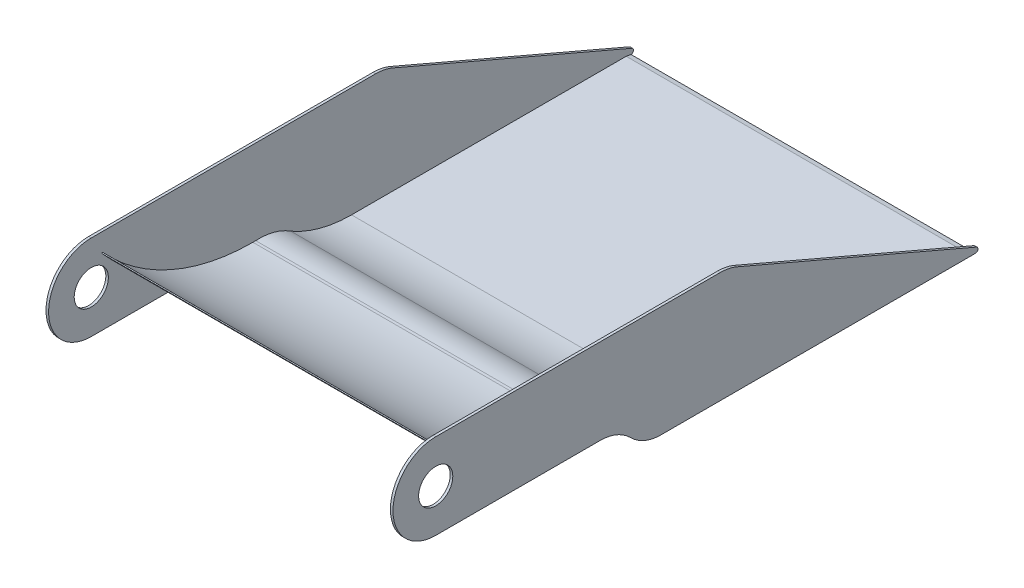
ISO-10303-21;
HEADER;
FILE_DESCRIPTION(('STEP AP214'),'2;1');
FILE_NAME('part.step','',(''),(''),'','','');
FILE_SCHEMA(('AUTOMOTIVE_DESIGN { 1 0 10303 214 1 1 1 1 }'));
ENDSEC;
DATA;
#1=APPLICATION_CONTEXT('core data for automotive mechanical design processes');
#2=APPLICATION_PROTOCOL_DEFINITION('international standard','automotive_design',2000,#1);
#3=PRODUCT_CONTEXT('',#1,'mechanical');
#4=PRODUCT('Part','Part','',(#3));
#5=PRODUCT_RELATED_PRODUCT_CATEGORY('part','',(#4));
#6=PRODUCT_DEFINITION_FORMATION('','',#4);
#7=PRODUCT_DEFINITION_CONTEXT('part definition',#1,'design');
#8=PRODUCT_DEFINITION('design','',#6,#7);
#9=PRODUCT_DEFINITION_SHAPE('','',#8);
#10=(LENGTH_UNIT() NAMED_UNIT(*) SI_UNIT(.MILLI.,.METRE.));
#11=(NAMED_UNIT(*) PLANE_ANGLE_UNIT() SI_UNIT($,.RADIAN.));
#12=(NAMED_UNIT(*) SI_UNIT($,.STERADIAN.) SOLID_ANGLE_UNIT());
#13=UNCERTAINTY_MEASURE_WITH_UNIT(LENGTH_MEASURE(1.E-05),#10,'distance_accuracy_value','');
#14=(GEOMETRIC_REPRESENTATION_CONTEXT(3) GLOBAL_UNCERTAINTY_ASSIGNED_CONTEXT((#13)) GLOBAL_UNIT_ASSIGNED_CONTEXT((#10,
#11,#12)) REPRESENTATION_CONTEXT('',''));
#15=CARTESIAN_POINT('',(0.,0.,0.));
#16=DIRECTION('',(0.,0.,1.));
#17=DIRECTION('',(1.,0.,0.));
#18=AXIS2_PLACEMENT_3D('',#15,#16,#17);
#19=CARTESIAN_POINT('',(3.,0.,-332.785481999993));
#20=DIRECTION('',(-1.,0.,0.));
#21=DIRECTION('',(0.,0.,1.));
#22=AXIS2_PLACEMENT_3D('',#19,#20,#21);
#23=CYLINDRICAL_SURFACE('',#22,50.);
#24=CARTESIAN_POINT('',(0.,0.,-332.785481999993));
#25=DIRECTION('',(1.,0.,0.));
#26=DIRECTION('',(0.,0.,-1.));
#27=AXIS2_PLACEMENT_3D('',#24,#25,#26);
#28=CIRCLE('',#27,50.);
#29=CARTESIAN_POINT('',(0.,50.,-332.785481999992));
#30=VERTEX_POINT('',#29);
#31=CARTESIAN_POINT('',(0.,45.9561533857204,-352.48400900046));
#32=VERTEX_POINT('',#31);
#33=EDGE_CURVE('E149',#30,#32,#28,.F.);
#34=ORIENTED_EDGE('',*,*,#33,.F.);
#35=DIRECTION('',(-1.,0.,0.));
#36=VECTOR('',#35,1.);
#37=CARTESIAN_POINT('',(3.,50.,-332.785481999992));
#38=LINE('',#37,#36);
#39=CARTESIAN_POINT('',(3.,50.,-332.785481999992));
#40=VERTEX_POINT('',#39);
#41=EDGE_CURVE('E11',#40,#30,#38,.T.);
#42=ORIENTED_EDGE('',*,*,#41,.F.);
#43=CARTESIAN_POINT('',(3.,0.,-332.785481999993));
#44=DIRECTION('',(1.,0.,0.));
#45=DIRECTION('',(0.,0.,-1.));
#46=AXIS2_PLACEMENT_3D('',#43,#44,#45);
#47=CIRCLE('',#46,50.);
#48=CARTESIAN_POINT('',(3.,45.9561533857204,-352.48400900046));
#49=VERTEX_POINT('',#48);
#50=EDGE_CURVE('E168',#40,#49,#47,.F.);
#51=ORIENTED_EDGE('',*,*,#50,.T.);
#52=DIRECTION('',(-1.,0.,0.));
#53=VECTOR('',#52,1.);
#54=CARTESIAN_POINT('',(3.,45.9561533857204,-352.48400900046));
#55=LINE('',#54,#53);
#56=EDGE_CURVE('E62',#49,#32,#55,.T.);
#57=ORIENTED_EDGE('',*,*,#56,.T.);
#58=EDGE_LOOP('',(#34,#42,#51,#57));
#59=FACE_BOUND('',#58,.T.);
#60=ADVANCED_FACE('F39',(#59),#23,.T.);
#61=CARTESIAN_POINT('',(3.,50.,0.));
#62=DIRECTION('',(0.,1.,0.));
#63=DIRECTION('',(0.,0.,1.));
#64=AXIS2_PLACEMENT_3D('',#61,#62,#63);
#65=PLANE('',#64);
#66=DIRECTION('',(0.,0.,-1.));
#67=VECTOR('',#66,1.);
#68=CARTESIAN_POINT('',(0.,50.,0.));
#69=LINE('',#68,#67);
#70=CARTESIAN_POINT('',(0.,50.,0.));
#71=VERTEX_POINT('',#70);
#72=EDGE_CURVE('E151',#71,#30,#69,.T.);
#73=ORIENTED_EDGE('',*,*,#72,.F.);
#74=DIRECTION('',(-1.,0.,0.));
#75=VECTOR('',#74,1.);
#76=CARTESIAN_POINT('',(3.,50.,0.));
#77=LINE('',#76,#75);
#78=CARTESIAN_POINT('',(3.,50.,0.));
#79=VERTEX_POINT('',#78);
#80=EDGE_CURVE('E46',#79,#71,#77,.T.);
#81=ORIENTED_EDGE('',*,*,#80,.F.);
#82=DIRECTION('',(0.,0.,-1.));
#83=VECTOR('',#82,1.);
#84=CARTESIAN_POINT('',(3.,50.,0.));
#85=LINE('',#84,#83);
#86=EDGE_CURVE('E199',#79,#40,#85,.T.);
#87=ORIENTED_EDGE('',*,*,#86,.T.);
#88=ORIENTED_EDGE('',*,*,#41,.T.);
#89=EDGE_LOOP('',(#73,#81,#87,#88));
#90=FACE_BOUND('',#89,.T.);
#91=ADVANCED_FACE('F198',(#90),#65,.T.);
#92=CARTESIAN_POINT('',(3.,0.,0.));
#93=DIRECTION('',(-1.,0.,0.));
#94=DIRECTION('',(0.,0.,1.));
#95=AXIS2_PLACEMENT_3D('',#92,#93,#94);
#96=CYLINDRICAL_SURFACE('',#95,50.);
#97=CARTESIAN_POINT('',(0.,0.,0.));
#98=DIRECTION('',(1.,0.,0.));
#99=DIRECTION('',(0.,0.,-1.));
#100=AXIS2_PLACEMENT_3D('',#97,#98,#99);
#101=CIRCLE('',#100,50.);
#102=CARTESIAN_POINT('',(0.,-50.,0.));
#103=VERTEX_POINT('',#102);
#104=EDGE_CURVE('E155',#71,#103,#101,.T.);
#105=ORIENTED_EDGE('',*,*,#104,.T.);
#106=DIRECTION('',(-1.,0.,0.));
#107=VECTOR('',#106,1.);
#108=CARTESIAN_POINT('',(3.,-50.,0.));
#109=LINE('',#108,#107);
#110=CARTESIAN_POINT('',(3.,-50.,0.));
#111=VERTEX_POINT('',#110);
#112=EDGE_CURVE('E181',#111,#103,#109,.T.);
#113=ORIENTED_EDGE('',*,*,#112,.F.);
#114=CARTESIAN_POINT('',(3.,0.,0.));
#115=DIRECTION('',(1.,0.,0.));
#116=DIRECTION('',(0.,0.,-1.));
#117=AXIS2_PLACEMENT_3D('',#114,#115,#116);
#118=CIRCLE('',#117,50.);
#119=EDGE_CURVE('E188',#79,#111,#118,.T.);
#120=ORIENTED_EDGE('',*,*,#119,.F.);
#121=ORIENTED_EDGE('',*,*,#80,.T.);
#122=EDGE_LOOP('',(#105,#113,#120,#121));
#123=FACE_BOUND('',#122,.T.);
#124=ADVANCED_FACE('F186',(#123),#96,.T.);
#125=CARTESIAN_POINT('',(3.,-50.,0.));
#126=DIRECTION('',(0.,1.,0.));
#127=DIRECTION('',(0.,0.,1.));
#128=AXIS2_PLACEMENT_3D('',#125,#126,#127);
#129=PLANE('',#128);
#130=DIRECTION('',(0.,0.,-1.));
#131=VECTOR('',#130,1.);
#132=CARTESIAN_POINT('',(0.,-50.,0.));
#133=LINE('',#132,#131);
#134=CARTESIAN_POINT('',(0.,-50.,-170.764869856477));
#135=VERTEX_POINT('',#134);
#136=EDGE_CURVE('E157',#103,#135,#133,.T.);
#137=ORIENTED_EDGE('',*,*,#136,.T.);
#138=DIRECTION('',(1.,0.,0.));
#139=VECTOR('',#138,1.);
#140=CARTESIAN_POINT('',(-400.,-50.,-170.764869856477));
#141=LINE('',#140,#139);
#142=CARTESIAN_POINT('',(-400.,-50.,-170.764869856477));
#143=VERTEX_POINT('',#142);
#144=EDGE_CURVE('E366',#143,#135,#141,.T.);
#145=ORIENTED_EDGE('',*,*,#144,.F.);
#146=DIRECTION('',(0.,0.,1.));
#147=VECTOR('',#146,1.);
#148=CARTESIAN_POINT('',(-400.,-50.,0.));
#149=LINE('',#148,#147);
#150=CARTESIAN_POINT('',(-400.,-50.,0.));
#151=VERTEX_POINT('',#150);
#152=EDGE_CURVE('E419',#143,#151,#149,.T.);
#153=ORIENTED_EDGE('',*,*,#152,.T.);
#154=DIRECTION('',(1.,0.,0.));
#155=VECTOR('',#154,1.);
#156=CARTESIAN_POINT('',(-403.,-50.,0.));
#157=LINE('',#156,#155);
#158=CARTESIAN_POINT('',(-403.,-50.,0.));
#159=VERTEX_POINT('',#158);
#160=EDGE_CURVE('E315',#159,#151,#157,.T.);
#161=ORIENTED_EDGE('',*,*,#160,.F.);
#162=DIRECTION('',(0.,0.,1.));
#163=VECTOR('',#162,1.);
#164=CARTESIAN_POINT('',(-403.,-50.,0.));
#165=LINE('',#164,#163);
#166=CARTESIAN_POINT('',(-403.,-50.,-192.417140489008));
#167=VERTEX_POINT('',#166);
#168=EDGE_CURVE('E405',#167,#159,#165,.T.);
#169=ORIENTED_EDGE('',*,*,#168,.F.);
#170=DIRECTION('',(-1.,0.,0.));
#171=VECTOR('',#170,1.);
#172=CARTESIAN_POINT('',(3.,-50.,-192.417140489008));
#173=LINE('',#172,#171);
#174=CARTESIAN_POINT('',(3.,-50.,-192.417140489008));
#175=VERTEX_POINT('',#174);
#176=EDGE_CURVE('E178',#175,#167,#173,.T.);
#177=ORIENTED_EDGE('',*,*,#176,.F.);
#178=DIRECTION('',(0.,0.,-1.));
#179=VECTOR('',#178,1.);
#180=CARTESIAN_POINT('',(3.,-50.,0.));
#181=LINE('',#180,#179);
#182=EDGE_CURVE('E383',#111,#175,#181,.T.);
#183=ORIENTED_EDGE('',*,*,#182,.F.);
#184=ORIENTED_EDGE('',*,*,#112,.T.);
#185=EDGE_LOOP('',(#137,#145,#153,#161,#169,#177,#183,#184));
#186=FACE_BOUND('',#185,.T.);
#187=ADVANCED_FACE('F488',(#186),#129,.F.);
#188=CARTESIAN_POINT('',(3.,-100.,-192.417140489008));
#189=DIRECTION('',(-1.,0.,0.));
#190=DIRECTION('',(0.,0.,1.));
#191=AXIS2_PLACEMENT_3D('',#188,#189,#190);
#192=CYLINDRICAL_SURFACE('',#191,50.);
#193=ORIENTED_EDGE('',*,*,#176,.T.);
#194=CARTESIAN_POINT('',(-403.,-100.,-192.417140489008));
#195=DIRECTION('',(-1.,0.,0.));
#196=DIRECTION('',(0.,0.,1.));
#197=AXIS2_PLACEMENT_3D('',#194,#195,#196);
#198=CIRCLE('',#197,50.);
#199=CARTESIAN_POINT('',(-403.,-64.6446609406728,-227.772479548336));
#200=VERTEX_POINT('',#199);
#201=EDGE_CURVE('E400',#200,#167,#198,.F.);
#202=ORIENTED_EDGE('',*,*,#201,.F.);
#203=DIRECTION('',(-1.,0.,0.));
#204=VECTOR('',#203,1.);
#205=CARTESIAN_POINT('',(3.,-64.6446609406728,-227.772479548336));
#206=LINE('',#205,#204);
#207=CARTESIAN_POINT('',(3.,-64.6446609406728,-227.772479548336));
#208=VERTEX_POINT('',#207);
#209=EDGE_CURVE('E175',#208,#200,#206,.T.);
#210=ORIENTED_EDGE('',*,*,#209,.F.);
#211=CARTESIAN_POINT('',(3.,-100.,-192.417140489008));
#212=DIRECTION('',(1.,0.,0.));
#213=DIRECTION('',(0.,0.,-1.));
#214=AXIS2_PLACEMENT_3D('',#211,#212,#213);
#215=CIRCLE('',#214,50.);
#216=EDGE_CURVE('E385',#175,#208,#215,.F.);
#217=ORIENTED_EDGE('',*,*,#216,.F.);
#218=EDGE_LOOP('',(#193,#202,#210,#217));
#219=FACE_BOUND('',#218,.T.);
#220=ADVANCED_FACE('F495',(#219),#192,.F.);
#221=CARTESIAN_POINT('',(3.,81.5639093038314,-81.5639093038314));
#222=DIRECTION('',(0.,0.707106781186547,-0.707106781186547));
#223=DIRECTION('',(0.,0.707106781186548,0.707106781186548));
#224=AXIS2_PLACEMENT_3D('',#221,#222,#223);
#225=PLANE('',#224);
#226=ORIENTED_EDGE('',*,*,#209,.T.);
#227=DIRECTION('',(0.,0.707106781186548,0.707106781186548));
#228=VECTOR('',#227,1.);
#229=CARTESIAN_POINT('',(-403.,81.5639093038314,-81.5639093038314));
#230=LINE('',#229,#228);
#231=CARTESIAN_POINT('',(-403.,-65.2773400190892,-228.405158626752));
#232=VERTEX_POINT('',#231);
#233=EDGE_CURVE('E396',#232,#200,#230,.T.);
#234=ORIENTED_EDGE('',*,*,#233,.F.);
#235=DIRECTION('',(-1.,0.,0.));
#236=VECTOR('',#235,1.);
#237=CARTESIAN_POINT('',(3.,-65.2773400190892,-228.405158626752));
#238=LINE('',#237,#236);
#239=CARTESIAN_POINT('',(3.,-65.2773400190892,-228.405158626752));
#240=VERTEX_POINT('',#239);
#241=EDGE_CURVE('E172',#240,#232,#238,.T.);
#242=ORIENTED_EDGE('',*,*,#241,.F.);
#243=DIRECTION('',(0.,-0.707106781186548,-0.707106781186548));
#244=VECTOR('',#243,1.);
#245=CARTESIAN_POINT('',(3.,81.5639093038314,-81.5639093038314));
#246=LINE('',#245,#244);
#247=EDGE_CURVE('E387',#208,#240,#246,.T.);
#248=ORIENTED_EDGE('',*,*,#247,.F.);
#249=EDGE_LOOP('',(#226,#234,#242,#248));
#250=FACE_BOUND('',#249,.T.);
#251=ADVANCED_FACE('F394',(#250),#225,.F.);
#252=CARTESIAN_POINT('',(3.,-29.9220009597619,-263.76049768608));
#253=DIRECTION('',(-1.,0.,0.));
#254=DIRECTION('',(0.,0.,1.));
#255=AXIS2_PLACEMENT_3D('',#252,#253,#254);
#256=CYLINDRICAL_SURFACE('',#255,50.);
#257=ORIENTED_EDGE('',*,*,#241,.T.);
#258=CARTESIAN_POINT('',(-403.,-29.9220009597619,-263.76049768608));
#259=DIRECTION('',(-1.,0.,0.));
#260=DIRECTION('',(0.,0.,1.));
#261=AXIS2_PLACEMENT_3D('',#258,#259,#260);
#262=CIRCLE('',#261,50.);
#263=CARTESIAN_POINT('',(-403.,-79.9220009597619,-263.76049768608));
#264=VERTEX_POINT('',#263);
#265=EDGE_CURVE('E299',#264,#232,#262,.T.);
#266=ORIENTED_EDGE('',*,*,#265,.F.);
#267=DIRECTION('',(-1.,0.,0.));
#268=VECTOR('',#267,1.);
#269=CARTESIAN_POINT('',(3.,-79.9220009597619,-263.76049768608));
#270=LINE('',#269,#268);
#271=CARTESIAN_POINT('',(3.,-79.9220009597619,-263.76049768608));
#272=VERTEX_POINT('',#271);
#273=EDGE_CURVE('E137',#272,#264,#270,.T.);
#274=ORIENTED_EDGE('',*,*,#273,.F.);
#275=CARTESIAN_POINT('',(3.,-29.9220009597619,-263.76049768608));
#276=DIRECTION('',(1.,0.,0.));
#277=DIRECTION('',(0.,0.,-1.));
#278=AXIS2_PLACEMENT_3D('',#275,#276,#277);
#279=CIRCLE('',#278,50.);
#280=EDGE_CURVE('E121',#240,#272,#279,.T.);
#281=ORIENTED_EDGE('',*,*,#280,.F.);
#282=EDGE_LOOP('',(#257,#266,#274,#281));
#283=FACE_BOUND('',#282,.T.);
#284=ADVANCED_FACE('F398',(#283),#256,.T.);
#285=CARTESIAN_POINT('',(3.,-79.9220009597619,0.));
#286=DIRECTION('',(0.,1.,0.));
#287=DIRECTION('',(0.,0.,1.));
#288=AXIS2_PLACEMENT_3D('',#285,#286,#287);
#289=PLANE('',#288);
#290=ORIENTED_EDGE('',*,*,#273,.T.);
#291=DIRECTION('',(0.,0.,1.));
#292=VECTOR('',#291,1.);
#293=CARTESIAN_POINT('',(-403.,-79.9220009597619,0.));
#294=LINE('',#293,#292);
#295=CARTESIAN_POINT('',(-403.,-79.9220009597619,-631.540778510428));
#296=VERTEX_POINT('',#295);
#297=EDGE_CURVE('E291',#296,#264,#294,.T.);
#298=ORIENTED_EDGE('',*,*,#297,.F.);
#299=DIRECTION('',(1.,0.,0.));
#300=VECTOR('',#299,1.);
#301=CARTESIAN_POINT('',(-403.,-79.9220009597619,-631.540778510428));
#302=LINE('',#301,#300);
#303=CARTESIAN_POINT('',(-400.,-79.9220009597619,-631.540778510428));
#304=VERTEX_POINT('',#303);
#305=EDGE_CURVE('E294',#296,#304,#302,.T.);
#306=ORIENTED_EDGE('',*,*,#305,.T.);
#307=DIRECTION('',(1.,0.,0.));
#308=VECTOR('',#307,1.);
#309=CARTESIAN_POINT('',(-400.,-79.9220009597619,-631.540778510428));
#310=LINE('',#309,#308);
#311=CARTESIAN_POINT('',(0.,-79.9220009597619,-631.540778510428));
#312=VERTEX_POINT('',#311);
#313=EDGE_CURVE('E133',#304,#312,#310,.T.);
#314=ORIENTED_EDGE('',*,*,#313,.T.);
#315=DIRECTION('',(-1.,0.,0.));
#316=VECTOR('',#315,1.);
#317=CARTESIAN_POINT('',(3.,-79.9220009597619,-631.540778510428));
#318=LINE('',#317,#316);
#319=CARTESIAN_POINT('',(3.,-79.9220009597619,-631.540778510428));
#320=VERTEX_POINT('',#319);
#321=EDGE_CURVE('E128',#320,#312,#318,.T.);
#322=ORIENTED_EDGE('',*,*,#321,.F.);
#323=DIRECTION('',(0.,0.,-1.));
#324=VECTOR('',#323,1.);
#325=CARTESIAN_POINT('',(3.,-79.9220009597619,0.));
#326=LINE('',#325,#324);
#327=EDGE_CURVE('E113',#272,#320,#326,.T.);
#328=ORIENTED_EDGE('',*,*,#327,.F.);
#329=EDGE_LOOP('',(#290,#298,#306,#314,#322,#328));
#330=FACE_BOUND('',#329,.T.);
#331=ADVANCED_FACE('F129',(#330),#289,.F.);
#332=CARTESIAN_POINT('',(3.,-76.9220009597619,-631.540778510429));
#333=DIRECTION('',(-1.,0.,0.));
#334=DIRECTION('',(0.,0.,1.));
#335=AXIS2_PLACEMENT_3D('',#332,#333,#334);
#336=CYLINDRICAL_SURFACE('',#335,3.);
#337=CARTESIAN_POINT('',(0.,-76.9220009597619,-631.540778510429));
#338=DIRECTION('',(1.,0.,0.));
#339=DIRECTION('',(0.,0.,-1.));
#340=AXIS2_PLACEMENT_3D('',#337,#338,#339);
#341=CIRCLE('',#340,3.);
#342=CARTESIAN_POINT('',(0.,-74.1646317566186,-632.722690130456));
#343=VERTEX_POINT('',#342);
#344=EDGE_CURVE('E160',#343,#312,#341,.F.);
#345=ORIENTED_EDGE('',*,*,#344,.F.);
#346=DIRECTION('',(-1.,0.,0.));
#347=VECTOR('',#346,1.);
#348=CARTESIAN_POINT('',(3.,-74.1646317566186,-632.722690130456));
#349=LINE('',#348,#347);
#350=CARTESIAN_POINT('',(3.,-74.1646317566186,-632.722690130456));
#351=VERTEX_POINT('',#350);
#352=EDGE_CURVE('E138',#351,#343,#349,.T.);
#353=ORIENTED_EDGE('',*,*,#352,.F.);
#354=CARTESIAN_POINT('',(3.,-76.9220009597619,-631.540778510429));
#355=DIRECTION('',(1.,0.,0.));
#356=DIRECTION('',(0.,0.,-1.));
#357=AXIS2_PLACEMENT_3D('',#354,#355,#356);
#358=CIRCLE('',#357,3.);
#359=EDGE_CURVE('E119',#351,#320,#358,.F.);
#360=ORIENTED_EDGE('',*,*,#359,.T.);
#361=ORIENTED_EDGE('',*,*,#321,.T.);
#362=EDGE_LOOP('',(#345,#353,#360,#361));
#363=FACE_BOUND('',#362,.T.);
#364=ADVANCED_FACE('F140',(#363),#336,.T.);
#365=CARTESIAN_POINT('',(3.,166.460242798444,-71.3510889335727));
#366=DIRECTION('',(0.,0.91912306771441,-0.393970540009341));
#367=DIRECTION('',(0.,0.393970540009341,0.91912306771441));
#368=AXIS2_PLACEMENT_3D('',#365,#366,#367);
#369=PLANE('',#368);
#370=DIRECTION('',(0.,-0.393970540009341,-0.91912306771441));
#371=VECTOR('',#370,1.);
#372=CARTESIAN_POINT('',(0.,166.460242798444,-71.3510889335727));
#373=LINE('',#372,#371);
#374=EDGE_CURVE('E162',#32,#343,#373,.T.);
#375=ORIENTED_EDGE('',*,*,#374,.F.);
#376=ORIENTED_EDGE('',*,*,#56,.F.);
#377=DIRECTION('',(0.,-0.393970540009341,-0.91912306771441));
#378=VECTOR('',#377,1.);
#379=CARTESIAN_POINT('',(3.,166.460242798444,-71.3510889335727));
#380=LINE('',#379,#378);
#381=EDGE_CURVE('E141',#49,#351,#380,.T.);
#382=ORIENTED_EDGE('',*,*,#381,.T.);
#383=ORIENTED_EDGE('',*,*,#352,.T.);
#384=EDGE_LOOP('',(#375,#376,#382,#383));
#385=FACE_BOUND('',#384,.T.);
#386=ADVANCED_FACE('F200',(#385),#369,.T.);
#387=CARTESIAN_POINT('',(3.,0.,0.));
#388=DIRECTION('',(-1.,0.,0.));
#389=DIRECTION('',(0.,0.,1.));
#390=AXIS2_PLACEMENT_3D('',#387,#388,#389);
#391=CYLINDRICAL_SURFACE('',#390,20.);
#392=CARTESIAN_POINT('',(3.,0.,0.));
#393=DIRECTION('',(1.,0.,0.));
#394=DIRECTION('',(0.,0.,-1.));
#395=AXIS2_PLACEMENT_3D('',#392,#393,#394);
#396=CIRCLE('',#395,20.);
#397=CARTESIAN_POINT('',(3.,0.,-20.));
#398=VERTEX_POINT('',#397);
#399=EDGE_CURVE('E143',#398,#398,#396,.T.);
#400=ORIENTED_EDGE('',*,*,#399,.T.);
#401=EDGE_LOOP('',(#400));
#402=FACE_BOUND('',#401,.T.);
#403=CARTESIAN_POINT('',(0.,0.,0.));
#404=DIRECTION('',(1.,0.,0.));
#405=DIRECTION('',(0.,0.,-1.));
#406=AXIS2_PLACEMENT_3D('',#403,#404,#405);
#407=CIRCLE('',#406,20.);
#408=CARTESIAN_POINT('',(0.,0.,-20.));
#409=VERTEX_POINT('',#408);
#410=EDGE_CURVE('E165',#409,#409,#407,.T.);
#411=ORIENTED_EDGE('',*,*,#410,.F.);
#412=EDGE_LOOP('',(#411));
#413=FACE_BOUND('',#412,.T.);
#414=ADVANCED_FACE('F699',(#402,#413),#391,.F.);
#415=CARTESIAN_POINT('',(3.,0.,0.));
#416=DIRECTION('',(1.,0.,0.));
#417=DIRECTION('',(0.,0.,-1.));
#418=AXIS2_PLACEMENT_3D('',#415,#416,#417);
#419=PLANE('',#418);
#420=ORIENTED_EDGE('',*,*,#50,.F.);
#421=ORIENTED_EDGE('',*,*,#86,.F.);
#422=ORIENTED_EDGE('',*,*,#119,.T.);
#423=ORIENTED_EDGE('',*,*,#182,.T.);
#424=ORIENTED_EDGE('',*,*,#216,.T.);
#425=ORIENTED_EDGE('',*,*,#247,.T.);
#426=ORIENTED_EDGE('',*,*,#280,.T.);
#427=ORIENTED_EDGE('',*,*,#327,.T.);
#428=ORIENTED_EDGE('',*,*,#359,.F.);
#429=ORIENTED_EDGE('',*,*,#381,.F.);
#430=EDGE_LOOP('',(#420,#421,#422,#423,#424,#425,#426,#427,#428,#429));
#431=FACE_BOUND('',#430,.T.);
#432=ORIENTED_EDGE('',*,*,#399,.F.);
#433=EDGE_LOOP('',(#432));
#434=FACE_BOUND('',#433,.T.);
#435=ADVANCED_FACE('F115',(#431,#434),#419,.T.);
#436=CARTESIAN_POINT('',(0.,0.,0.));
#437=DIRECTION('',(1.,0.,0.));
#438=DIRECTION('',(0.,0.,-1.));
#439=AXIS2_PLACEMENT_3D('',#436,#437,#438);
#440=PLANE('',#439);
#441=CARTESIAN_POINT('',(0.,181.546874434882,-186.402772011881));
#442=DIRECTION('',(-1.,0.,0.));
#443=DIRECTION('',(0.,0.,1.));
#444=AXIS2_PLACEMENT_3D('',#441,#442,#443);
#445=CIRCLE('',#444,232.074339478507);
#446=CARTESIAN_POINT('',(0.,28.1961933496544,-12.2130258869102));
#447=VERTEX_POINT('',#446);
#448=EDGE_CURVE('E327',#135,#447,#445,.T.);
#449=ORIENTED_EDGE('',*,*,#448,.F.);
#450=ORIENTED_EDGE('',*,*,#136,.F.);
#451=ORIENTED_EDGE('',*,*,#104,.F.);
#452=ORIENTED_EDGE('',*,*,#72,.T.);
#453=ORIENTED_EDGE('',*,*,#33,.T.);
#454=ORIENTED_EDGE('',*,*,#374,.T.);
#455=ORIENTED_EDGE('',*,*,#344,.T.);
#456=DIRECTION('',(0.,-0.173648177666925,-0.984807753012209));
#457=VECTOR('',#456,1.);
#458=CARTESIAN_POINT('',(0.,30.48777604102,-5.37581749782877));
#459=LINE('',#458,#457);
#460=CARTESIAN_POINT('',(0.,-78.9220009597619,-625.869496690811));
#461=VERTEX_POINT('',#460);
#462=EDGE_CURVE('E205',#461,#312,#459,.T.);
#463=ORIENTED_EDGE('',*,*,#462,.F.);
#464=DIRECTION('',(0.,0.,-1.));
#465=VECTOR('',#464,1.);
#466=CARTESIAN_POINT('',(0.,-78.9220009597619,0.));
#467=LINE('',#466,#465);
#468=CARTESIAN_POINT('',(0.,-78.9220009597619,-304.494792616644));
#469=VERTEX_POINT('',#468);
#470=EDGE_CURVE('E360',#469,#461,#467,.T.);
#471=ORIENTED_EDGE('',*,*,#470,.F.);
#472=CARTESIAN_POINT('',(0.,63.4285071680447,-304.494792616644));
#473=DIRECTION('',(-1.,0.,0.));
#474=DIRECTION('',(0.,0.,1.));
#475=AXIS2_PLACEMENT_3D('',#472,#473,#474);
#476=CIRCLE('',#475,142.350508127807);
#477=CARTESIAN_POINT('',(0.,-60.0158166926809,-233.606386859334));
#478=VERTEX_POINT('',#477);
#479=EDGE_CURVE('E357',#469,#478,#476,.T.);
#480=ORIENTED_EDGE('',*,*,#479,.T.);
#481=CARTESIAN_POINT('',(0.,-116.13706605141,-196.529415390847));
#482=DIRECTION('',(-1.,0.,0.));
#483=DIRECTION('',(0.,0.,1.));
#484=AXIS2_PLACEMENT_3D('',#481,#482,#483);
#485=CIRCLE('',#484,67.2628905330395);
#486=CARTESIAN_POINT('',(0.,-49.,-192.417140489008));
#487=VERTEX_POINT('',#486);
#488=EDGE_CURVE('E354',#478,#487,#485,.F.);
#489=ORIENTED_EDGE('',*,*,#488,.T.);
#490=DIRECTION('',(0.,0.,1.));
#491=VECTOR('',#490,1.);
#492=CARTESIAN_POINT('',(0.,-49.,0.));
#493=LINE('',#492,#491);
#494=CARTESIAN_POINT('',(0.,-49.,-189.104289811804));
#495=VERTEX_POINT('',#494);
#496=EDGE_CURVE('E351',#487,#495,#493,.T.);
#497=ORIENTED_EDGE('',*,*,#496,.T.);
#498=CARTESIAN_POINT('',(0.,188.678584575131,-189.104289811804));
#499=DIRECTION('',(-1.,0.,0.));
#500=DIRECTION('',(0.,0.,1.));
#501=AXIS2_PLACEMENT_3D('',#498,#499,#500);
#502=CIRCLE('',#501,237.678584575131);
#503=CARTESIAN_POINT('',(0.,28.4188940179382,-13.5823790765612));
#504=VERTEX_POINT('',#503);
#505=EDGE_CURVE('E317',#495,#504,#502,.T.);
#506=ORIENTED_EDGE('',*,*,#505,.T.);
#507=CARTESIAN_POINT('',(0.,27.8227538988135,-12.9765448212496));
#508=DIRECTION('',(-1.,0.,0.));
#509=DIRECTION('',(0.,0.,1.));
#510=AXIS2_PLACEMENT_3D('',#507,#508,#509);
#511=CIRCLE('',#510,0.849951873072284);
#512=EDGE_CURVE('E53',#504,#447,#511,.F.);
#513=ORIENTED_EDGE('',*,*,#512,.T.);
#514=EDGE_LOOP('',(#449,#450,#451,#452,#453,#454,#455,#463,#471,#480,#489,#497,#506,#513));
#515=FACE_BOUND('',#514,.T.);
#516=ORIENTED_EDGE('',*,*,#410,.T.);
#517=EDGE_LOOP('',(#516));
#518=FACE_BOUND('',#517,.T.);
#519=ADVANCED_FACE('F196',(#515,#518),#440,.F.);
#520=CARTESIAN_POINT('',(-400.,27.8227538988135,-12.9765448212496));
#521=DIRECTION('',(1.,0.,0.));
#522=DIRECTION('',(0.,0.,-1.));
#523=AXIS2_PLACEMENT_3D('',#520,#521,#522);
#524=CYLINDRICAL_SURFACE('',#523,0.849951873072284);
#525=ORIENTED_EDGE('',*,*,#512,.F.);
#526=DIRECTION('',(1.,0.,0.));
#527=VECTOR('',#526,1.);
#528=CARTESIAN_POINT('',(-400.,28.4188940179382,-13.5823790765612));
#529=LINE('',#528,#527);
#530=CARTESIAN_POINT('',(-400.,28.4188940179382,-13.5823790765612));
#531=VERTEX_POINT('',#530);
#532=EDGE_CURVE('E152',#531,#504,#529,.T.);
#533=ORIENTED_EDGE('',*,*,#532,.F.);
#534=CARTESIAN_POINT('',(-400.,27.8227538988135,-12.9765448212496));
#535=DIRECTION('',(-1.,0.,0.));
#536=DIRECTION('',(0.,0.,1.));
#537=AXIS2_PLACEMENT_3D('',#534,#535,#536);
#538=CIRCLE('',#537,0.849951873072284);
#539=CARTESIAN_POINT('',(-400.,28.1961933496544,-12.2130258869102));
#540=VERTEX_POINT('',#539);
#541=EDGE_CURVE('E324',#531,#540,#538,.F.);
#542=ORIENTED_EDGE('',*,*,#541,.T.);
#543=DIRECTION('',(1.,0.,0.));
#544=VECTOR('',#543,1.);
#545=CARTESIAN_POINT('',(-400.,28.1961933496544,-12.2130258869102));
#546=LINE('',#545,#544);
#547=EDGE_CURVE('E347',#540,#447,#546,.T.);
#548=ORIENTED_EDGE('',*,*,#547,.T.);
#549=EDGE_LOOP('',(#525,#533,#542,#548));
#550=FACE_BOUND('',#549,.T.);
#551=ADVANCED_FACE('F481',(#550),#524,.T.);
#552=CARTESIAN_POINT('',(-400.,188.678584575131,-189.104289811804));
#553=DIRECTION('',(1.,0.,0.));
#554=DIRECTION('',(0.,0.,-1.));
#555=AXIS2_PLACEMENT_3D('',#552,#553,#554);
#556=CYLINDRICAL_SURFACE('',#555,237.678584575131);
#557=ORIENTED_EDGE('',*,*,#505,.F.);
#558=DIRECTION('',(1.,0.,0.));
#559=VECTOR('',#558,1.);
#560=CARTESIAN_POINT('',(-400.,-49.,-189.104289811804));
#561=LINE('',#560,#559);
#562=CARTESIAN_POINT('',(-400.,-49.,-189.104289811804));
#563=VERTEX_POINT('',#562);
#564=EDGE_CURVE('E377',#563,#495,#561,.T.);
#565=ORIENTED_EDGE('',*,*,#564,.F.);
#566=CARTESIAN_POINT('',(-400.,188.678584575131,-189.104289811804));
#567=DIRECTION('',(-1.,0.,0.));
#568=DIRECTION('',(0.,0.,1.));
#569=AXIS2_PLACEMENT_3D('',#566,#567,#568);
#570=CIRCLE('',#569,237.678584575131);
#571=EDGE_CURVE('E326',#563,#531,#570,.T.);
#572=ORIENTED_EDGE('',*,*,#571,.T.);
#573=ORIENTED_EDGE('',*,*,#532,.T.);
#574=EDGE_LOOP('',(#557,#565,#572,#573));
#575=FACE_BOUND('',#574,.T.);
#576=ADVANCED_FACE('F478',(#575),#556,.F.);
#577=CARTESIAN_POINT('',(-400.,-49.,0.));
#578=DIRECTION('',(0.,1.,0.));
#579=DIRECTION('',(0.,0.,1.));
#580=AXIS2_PLACEMENT_3D('',#577,#578,#579);
#581=PLANE('',#580);
#582=ORIENTED_EDGE('',*,*,#496,.F.);
#583=DIRECTION('',(1.,0.,0.));
#584=VECTOR('',#583,1.);
#585=CARTESIAN_POINT('',(-400.,-49.,-192.417140489008));
#586=LINE('',#585,#584);
#587=CARTESIAN_POINT('',(-400.,-49.,-192.417140489008));
#588=VERTEX_POINT('',#587);
#589=EDGE_CURVE('E375',#588,#487,#586,.T.);
#590=ORIENTED_EDGE('',*,*,#589,.F.);
#591=DIRECTION('',(0.,0.,1.));
#592=VECTOR('',#591,1.);
#593=CARTESIAN_POINT('',(-400.,-49.,0.));
#594=LINE('',#593,#592);
#595=EDGE_CURVE('E330',#588,#563,#594,.T.);
#596=ORIENTED_EDGE('',*,*,#595,.T.);
#597=ORIENTED_EDGE('',*,*,#564,.T.);
#598=EDGE_LOOP('',(#582,#590,#596,#597));
#599=FACE_BOUND('',#598,.T.);
#600=ADVANCED_FACE('F475',(#599),#581,.T.);
#601=CARTESIAN_POINT('',(-400.,-116.13706605141,-196.529415390847));
#602=DIRECTION('',(1.,0.,0.));
#603=DIRECTION('',(0.,0.,-1.));
#604=AXIS2_PLACEMENT_3D('',#601,#602,#603);
#605=CYLINDRICAL_SURFACE('',#604,67.2628905330395);
#606=ORIENTED_EDGE('',*,*,#488,.F.);
#607=DIRECTION('',(1.,0.,0.));
#608=VECTOR('',#607,1.);
#609=CARTESIAN_POINT('',(-400.,-60.0158166926809,-233.606386859334));
#610=LINE('',#609,#608);
#611=CARTESIAN_POINT('',(-400.,-60.0158166926809,-233.606386859334));
#612=VERTEX_POINT('',#611);
#613=EDGE_CURVE('E373',#612,#478,#610,.T.);
#614=ORIENTED_EDGE('',*,*,#613,.F.);
#615=CARTESIAN_POINT('',(-400.,-116.13706605141,-196.529415390847));
#616=DIRECTION('',(-1.,0.,0.));
#617=DIRECTION('',(0.,0.,1.));
#618=AXIS2_PLACEMENT_3D('',#615,#616,#617);
#619=CIRCLE('',#618,67.2628905330395);
#620=EDGE_CURVE('E333',#612,#588,#619,.F.);
#621=ORIENTED_EDGE('',*,*,#620,.T.);
#622=ORIENTED_EDGE('',*,*,#589,.T.);
#623=EDGE_LOOP('',(#606,#614,#621,#622));
#624=FACE_BOUND('',#623,.T.);
#625=ADVANCED_FACE('F471',(#624),#605,.T.);
#626=CARTESIAN_POINT('',(-400.,63.4285071680447,-304.494792616644));
#627=DIRECTION('',(1.,0.,0.));
#628=DIRECTION('',(0.,0.,-1.));
#629=AXIS2_PLACEMENT_3D('',#626,#627,#628);
#630=CYLINDRICAL_SURFACE('',#629,142.350508127807);
#631=ORIENTED_EDGE('',*,*,#479,.F.);
#632=DIRECTION('',(1.,0.,0.));
#633=VECTOR('',#632,1.);
#634=CARTESIAN_POINT('',(-400.,-78.9220009597619,-304.494792616644));
#635=LINE('',#634,#633);
#636=CARTESIAN_POINT('',(-400.,-78.9220009597619,-304.494792616644));
#637=VERTEX_POINT('',#636);
#638=EDGE_CURVE('E371',#637,#469,#635,.T.);
#639=ORIENTED_EDGE('',*,*,#638,.F.);
#640=CARTESIAN_POINT('',(-400.,63.4285071680447,-304.494792616644));
#641=DIRECTION('',(-1.,0.,0.));
#642=DIRECTION('',(0.,0.,1.));
#643=AXIS2_PLACEMENT_3D('',#640,#641,#642);
#644=CIRCLE('',#643,142.350508127807);
#645=EDGE_CURVE('E336',#637,#612,#644,.T.);
#646=ORIENTED_EDGE('',*,*,#645,.T.);
#647=ORIENTED_EDGE('',*,*,#613,.T.);
#648=EDGE_LOOP('',(#631,#639,#646,#647));
#649=FACE_BOUND('',#648,.T.);
#650=ADVANCED_FACE('F468',(#649),#630,.F.);
#651=CARTESIAN_POINT('',(-400.,-78.9220009597619,0.));
#652=DIRECTION('',(0.,-1.,0.));
#653=DIRECTION('',(0.,0.,-1.));
#654=AXIS2_PLACEMENT_3D('',#651,#652,#653);
#655=PLANE('',#654);
#656=ORIENTED_EDGE('',*,*,#470,.T.);
#657=DIRECTION('',(1.,0.,0.));
#658=VECTOR('',#657,1.);
#659=CARTESIAN_POINT('',(-400.,-78.9220009597619,-625.869496690811));
#660=LINE('',#659,#658);
#661=CARTESIAN_POINT('',(-400.,-78.9220009597619,-625.869496690811));
#662=VERTEX_POINT('',#661);
#663=EDGE_CURVE('E369',#662,#461,#660,.T.);
#664=ORIENTED_EDGE('',*,*,#663,.F.);
#665=DIRECTION('',(0.,0.,-1.));
#666=VECTOR('',#665,1.);
#667=CARTESIAN_POINT('',(-400.,-78.9220009597619,0.));
#668=LINE('',#667,#666);
#669=EDGE_CURVE('E339',#637,#662,#668,.T.);
#670=ORIENTED_EDGE('',*,*,#669,.F.);
#671=ORIENTED_EDGE('',*,*,#638,.T.);
#672=EDGE_LOOP('',(#656,#664,#670,#671));
#673=FACE_BOUND('',#672,.T.);
#674=ADVANCED_FACE('F464',(#673),#655,.F.);
#675=CARTESIAN_POINT('',(-400.,30.48777604102,-5.37581749782877));
#676=DIRECTION('',(0.,-0.984807753012209,0.173648177666925));
#677=DIRECTION('',(0.,-0.173648177666925,-0.984807753012209));
#678=AXIS2_PLACEMENT_3D('',#675,#676,#677);
#679=PLANE('',#678);
#680=ORIENTED_EDGE('',*,*,#462,.T.);
#681=ORIENTED_EDGE('',*,*,#313,.F.);
#682=DIRECTION('',(0.,-0.173648177666925,-0.984807753012209));
#683=VECTOR('',#682,1.);
#684=CARTESIAN_POINT('',(-400.,30.48777604102,-5.37581749782877));
#685=LINE('',#684,#683);
#686=EDGE_CURVE('E342',#662,#304,#685,.T.);
#687=ORIENTED_EDGE('',*,*,#686,.F.);
#688=ORIENTED_EDGE('',*,*,#663,.T.);
#689=EDGE_LOOP('',(#680,#681,#687,#688));
#690=FACE_BOUND('',#689,.T.);
#691=ADVANCED_FACE('F462',(#690),#679,.F.);
#692=CARTESIAN_POINT('',(-400.,181.546874434882,-186.402772011881));
#693=DIRECTION('',(1.,0.,0.));
#694=DIRECTION('',(0.,0.,-1.));
#695=AXIS2_PLACEMENT_3D('',#692,#693,#694);
#696=CYLINDRICAL_SURFACE('',#695,232.074339478507);
#697=ORIENTED_EDGE('',*,*,#448,.T.);
#698=ORIENTED_EDGE('',*,*,#547,.F.);
#699=CARTESIAN_POINT('',(-400.,181.546874434882,-186.402772011881));
#700=DIRECTION('',(-1.,0.,0.));
#701=DIRECTION('',(0.,0.,1.));
#702=AXIS2_PLACEMENT_3D('',#699,#700,#701);
#703=CIRCLE('',#702,232.074339478507);
#704=EDGE_CURVE('E345',#143,#540,#703,.T.);
#705=ORIENTED_EDGE('',*,*,#704,.F.);
#706=ORIENTED_EDGE('',*,*,#144,.T.);
#707=EDGE_LOOP('',(#697,#698,#705,#706));
#708=FACE_BOUND('',#707,.T.);
#709=ADVANCED_FACE('F485',(#708),#696,.T.);
#710=CARTESIAN_POINT('',(-403.,-76.9220009597619,-631.540778510429));
#711=DIRECTION('',(1.,0.,0.));
#712=DIRECTION('',(0.,0.,-1.));
#713=AXIS2_PLACEMENT_3D('',#710,#711,#712);
#714=CYLINDRICAL_SURFACE('',#713,2.99999999999999);
#715=CARTESIAN_POINT('',(-400.,-76.9220009597619,-631.540778510429));
#716=DIRECTION('',(-1.,0.,0.));
#717=DIRECTION('',(0.,0.,1.));
#718=AXIS2_PLACEMENT_3D('',#715,#716,#717);
#719=CIRCLE('',#718,2.99999999999999);
#720=CARTESIAN_POINT('',(-400.,-74.1646317566186,-632.722690130456));
#721=VERTEX_POINT('',#720);
#722=EDGE_CURVE('E314',#721,#304,#719,.T.);
#723=ORIENTED_EDGE('',*,*,#722,.T.);
#724=ORIENTED_EDGE('',*,*,#305,.F.);
#725=CARTESIAN_POINT('',(-403.,-76.9220009597619,-631.540778510429));
#726=DIRECTION('',(-1.,0.,0.));
#727=DIRECTION('',(0.,0.,1.));
#728=AXIS2_PLACEMENT_3D('',#725,#726,#727);
#729=CIRCLE('',#728,2.99999999999999);
#730=CARTESIAN_POINT('',(-403.,-74.1646317566186,-632.722690130456));
#731=VERTEX_POINT('',#730);
#732=EDGE_CURVE('E300',#731,#296,#729,.T.);
#733=ORIENTED_EDGE('',*,*,#732,.F.);
#734=DIRECTION('',(1.,0.,0.));
#735=VECTOR('',#734,1.);
#736=CARTESIAN_POINT('',(-403.,-74.1646317566186,-632.722690130456));
#737=LINE('',#736,#735);
#738=EDGE_CURVE('E417',#731,#721,#737,.T.);
#739=ORIENTED_EDGE('',*,*,#738,.T.);
#740=EDGE_LOOP('',(#723,#724,#733,#739));
#741=FACE_BOUND('',#740,.T.);
#742=ADVANCED_FACE('F312',(#741),#714,.T.);
#743=CARTESIAN_POINT('',(-403.,0.,0.));
#744=DIRECTION('',(1.,0.,0.));
#745=DIRECTION('',(0.,0.,-1.));
#746=AXIS2_PLACEMENT_3D('',#743,#744,#745);
#747=CYLINDRICAL_SURFACE('',#746,50.);
#748=CARTESIAN_POINT('',(-400.,0.,0.));
#749=DIRECTION('',(-1.,0.,0.));
#750=DIRECTION('',(0.,0.,1.));
#751=AXIS2_PLACEMENT_3D('',#748,#749,#750);
#752=CIRCLE('',#751,50.);
#753=CARTESIAN_POINT('',(-400.,50.,0.));
#754=VERTEX_POINT('',#753);
#755=EDGE_CURVE('E421',#151,#754,#752,.T.);
#756=ORIENTED_EDGE('',*,*,#755,.T.);
#757=DIRECTION('',(1.,0.,0.));
#758=VECTOR('',#757,1.);
#759=CARTESIAN_POINT('',(-403.,50.,0.));
#760=LINE('',#759,#758);
#761=CARTESIAN_POINT('',(-403.,50.,0.));
#762=VERTEX_POINT('',#761);
#763=EDGE_CURVE('E320',#762,#754,#760,.T.);
#764=ORIENTED_EDGE('',*,*,#763,.F.);
#765=CARTESIAN_POINT('',(-403.,0.,0.));
#766=DIRECTION('',(-1.,0.,0.));
#767=DIRECTION('',(0.,0.,1.));
#768=AXIS2_PLACEMENT_3D('',#765,#766,#767);
#769=CIRCLE('',#768,50.);
#770=EDGE_CURVE('E407',#159,#762,#769,.T.);
#771=ORIENTED_EDGE('',*,*,#770,.F.);
#772=ORIENTED_EDGE('',*,*,#160,.T.);
#773=EDGE_LOOP('',(#756,#764,#771,#772));
#774=FACE_BOUND('',#773,.T.);
#775=ADVANCED_FACE('F490',(#774),#747,.T.);
#776=CARTESIAN_POINT('',(-403.,50.,0.));
#777=DIRECTION('',(0.,-1.,0.));
#778=DIRECTION('',(0.,0.,-1.));
#779=AXIS2_PLACEMENT_3D('',#776,#777,#778);
#780=PLANE('',#779);
#781=DIRECTION('',(0.,0.,-1.));
#782=VECTOR('',#781,1.);
#783=CARTESIAN_POINT('',(-400.,50.,0.));
#784=LINE('',#783,#782);
#785=CARTESIAN_POINT('',(-400.,50.,-332.785481999992));
#786=VERTEX_POINT('',#785);
#787=EDGE_CURVE('E423',#754,#786,#784,.T.);
#788=ORIENTED_EDGE('',*,*,#787,.T.);
#789=DIRECTION('',(1.,0.,0.));
#790=VECTOR('',#789,1.);
#791=CARTESIAN_POINT('',(-403.,50.,-332.785481999992));
#792=LINE('',#791,#790);
#793=CARTESIAN_POINT('',(-403.,50.,-332.785481999992));
#794=VERTEX_POINT('',#793);
#795=EDGE_CURVE('E435',#794,#786,#792,.T.);
#796=ORIENTED_EDGE('',*,*,#795,.F.);
#797=DIRECTION('',(0.,0.,-1.));
#798=VECTOR('',#797,1.);
#799=CARTESIAN_POINT('',(-403.,50.,0.));
#800=LINE('',#799,#798);
#801=EDGE_CURVE('E409',#762,#794,#800,.T.);
#802=ORIENTED_EDGE('',*,*,#801,.F.);
#803=ORIENTED_EDGE('',*,*,#763,.T.);
#804=EDGE_LOOP('',(#788,#796,#802,#803));
#805=FACE_BOUND('',#804,.T.);
#806=ADVANCED_FACE('F442',(#805),#780,.F.);
#807=CARTESIAN_POINT('',(-403.,0.,-332.785481999993));
#808=DIRECTION('',(1.,0.,0.));
#809=DIRECTION('',(0.,0.,-1.));
#810=AXIS2_PLACEMENT_3D('',#807,#808,#809);
#811=CYLINDRICAL_SURFACE('',#810,50.);
#812=CARTESIAN_POINT('',(-400.,0.,-332.785481999993));
#813=DIRECTION('',(-1.,0.,0.));
#814=DIRECTION('',(0.,0.,1.));
#815=AXIS2_PLACEMENT_3D('',#812,#813,#814);
#816=CIRCLE('',#815,50.);
#817=CARTESIAN_POINT('',(-400.,45.9561533857204,-352.48400900046));
#818=VERTEX_POINT('',#817);
#819=EDGE_CURVE('E425',#786,#818,#816,.T.);
#820=ORIENTED_EDGE('',*,*,#819,.T.);
#821=DIRECTION('',(1.,0.,0.));
#822=VECTOR('',#821,1.);
#823=CARTESIAN_POINT('',(-403.,45.9561533857204,-352.48400900046));
#824=LINE('',#823,#822);
#825=CARTESIAN_POINT('',(-403.,45.9561533857204,-352.48400900046));
#826=VERTEX_POINT('',#825);
#827=EDGE_CURVE('E432',#826,#818,#824,.T.);
#828=ORIENTED_EDGE('',*,*,#827,.F.);
#829=CARTESIAN_POINT('',(-403.,0.,-332.785481999993));
#830=DIRECTION('',(-1.,0.,0.));
#831=DIRECTION('',(0.,0.,1.));
#832=AXIS2_PLACEMENT_3D('',#829,#830,#831);
#833=CIRCLE('',#832,50.);
#834=EDGE_CURVE('E411',#794,#826,#833,.T.);
#835=ORIENTED_EDGE('',*,*,#834,.F.);
#836=ORIENTED_EDGE('',*,*,#795,.T.);
#837=EDGE_LOOP('',(#820,#828,#835,#836));
#838=FACE_BOUND('',#837,.T.);
#839=ADVANCED_FACE('F455',(#838),#811,.T.);
#840=CARTESIAN_POINT('',(-403.,166.460242798444,-71.3510889335727));
#841=DIRECTION('',(0.,-0.91912306771441,0.393970540009341));
#842=DIRECTION('',(0.,-0.393970540009341,-0.91912306771441));
#843=AXIS2_PLACEMENT_3D('',#840,#841,#842);
#844=PLANE('',#843);
#845=DIRECTION('',(0.,-0.393970540009341,-0.91912306771441));
#846=VECTOR('',#845,1.);
#847=CARTESIAN_POINT('',(-400.,166.460242798444,-71.3510889335727));
#848=LINE('',#847,#846);
#849=EDGE_CURVE('E427',#818,#721,#848,.T.);
#850=ORIENTED_EDGE('',*,*,#849,.T.);
#851=ORIENTED_EDGE('',*,*,#738,.F.);
#852=DIRECTION('',(0.,-0.393970540009341,-0.91912306771441));
#853=VECTOR('',#852,1.);
#854=CARTESIAN_POINT('',(-403.,166.460242798444,-71.3510889335727));
#855=LINE('',#854,#853);
#856=EDGE_CURVE('E306',#826,#731,#855,.T.);
#857=ORIENTED_EDGE('',*,*,#856,.F.);
#858=ORIENTED_EDGE('',*,*,#827,.T.);
#859=EDGE_LOOP('',(#850,#851,#857,#858));
#860=FACE_BOUND('',#859,.T.);
#861=ADVANCED_FACE('F458',(#860),#844,.F.);
#862=CARTESIAN_POINT('',(-403.,0.,0.));
#863=DIRECTION('',(1.,0.,0.));
#864=DIRECTION('',(0.,0.,-1.));
#865=AXIS2_PLACEMENT_3D('',#862,#863,#864);
#866=CYLINDRICAL_SURFACE('',#865,20.);
#867=CARTESIAN_POINT('',(-403.,0.,0.));
#868=DIRECTION('',(-1.,0.,0.));
#869=DIRECTION('',(0.,0.,1.));
#870=AXIS2_PLACEMENT_3D('',#867,#868,#869);
#871=CIRCLE('',#870,20.);
#872=CARTESIAN_POINT('',(-403.,0.,20.));
#873=VERTEX_POINT('',#872);
#874=EDGE_CURVE('E414',#873,#873,#871,.T.);
#875=ORIENTED_EDGE('',*,*,#874,.T.);
#876=EDGE_LOOP('',(#875));
#877=FACE_BOUND('',#876,.T.);
#878=CARTESIAN_POINT('',(-400.,0.,0.));
#879=DIRECTION('',(-1.,0.,0.));
#880=DIRECTION('',(0.,0.,1.));
#881=AXIS2_PLACEMENT_3D('',#878,#879,#880);
#882=CIRCLE('',#881,20.);
#883=CARTESIAN_POINT('',(-400.,0.,20.));
#884=VERTEX_POINT('',#883);
#885=EDGE_CURVE('E310',#884,#884,#882,.T.);
#886=ORIENTED_EDGE('',*,*,#885,.F.);
#887=EDGE_LOOP('',(#886));
#888=FACE_BOUND('',#887,.T.);
#889=ADVANCED_FACE('F663',(#877,#888),#866,.F.);
#890=CARTESIAN_POINT('',(-403.,0.,0.));
#891=DIRECTION('',(-1.,0.,0.));
#892=DIRECTION('',(0.,0.,1.));
#893=AXIS2_PLACEMENT_3D('',#890,#891,#892);
#894=PLANE('',#893);
#895=ORIENTED_EDGE('',*,*,#732,.T.);
#896=ORIENTED_EDGE('',*,*,#297,.T.);
#897=ORIENTED_EDGE('',*,*,#265,.T.);
#898=ORIENTED_EDGE('',*,*,#233,.T.);
#899=ORIENTED_EDGE('',*,*,#201,.T.);
#900=ORIENTED_EDGE('',*,*,#168,.T.);
#901=ORIENTED_EDGE('',*,*,#770,.T.);
#902=ORIENTED_EDGE('',*,*,#801,.T.);
#903=ORIENTED_EDGE('',*,*,#834,.T.);
#904=ORIENTED_EDGE('',*,*,#856,.T.);
#905=EDGE_LOOP('',(#895,#896,#897,#898,#899,#900,#901,#902,#903,#904));
#906=FACE_BOUND('',#905,.T.);
#907=ORIENTED_EDGE('',*,*,#874,.F.);
#908=EDGE_LOOP('',(#907));
#909=FACE_BOUND('',#908,.T.);
#910=ADVANCED_FACE('F303',(#906,#909),#894,.T.);
#911=CARTESIAN_POINT('',(-400.,0.,0.));
#912=DIRECTION('',(-1.,0.,0.));
#913=DIRECTION('',(0.,0.,1.));
#914=AXIS2_PLACEMENT_3D('',#911,#912,#913);
#915=PLANE('',#914);
#916=ORIENTED_EDGE('',*,*,#669,.T.);
#917=ORIENTED_EDGE('',*,*,#686,.T.);
#918=ORIENTED_EDGE('',*,*,#722,.F.);
#919=ORIENTED_EDGE('',*,*,#849,.F.);
#920=ORIENTED_EDGE('',*,*,#819,.F.);
#921=ORIENTED_EDGE('',*,*,#787,.F.);
#922=ORIENTED_EDGE('',*,*,#755,.F.);
#923=ORIENTED_EDGE('',*,*,#152,.F.);
#924=ORIENTED_EDGE('',*,*,#704,.T.);
#925=ORIENTED_EDGE('',*,*,#541,.F.);
#926=ORIENTED_EDGE('',*,*,#571,.F.);
#927=ORIENTED_EDGE('',*,*,#595,.F.);
#928=ORIENTED_EDGE('',*,*,#620,.F.);
#929=ORIENTED_EDGE('',*,*,#645,.F.);
#930=EDGE_LOOP('',(#916,#917,#918,#919,#920,#921,#922,#923,#924,#925,#926,#927,#928,#929));
#931=FACE_BOUND('',#930,.T.);
#932=ORIENTED_EDGE('',*,*,#885,.T.);
#933=EDGE_LOOP('',(#932));
#934=FACE_BOUND('',#933,.T.);
#935=ADVANCED_FACE('F449',(#931,#934),#915,.F.);
#936=CLOSED_SHELL('',(#60,#91,#124,#187,#220,#251,#284,#331,#364,#386,#414,#435,#519,#551,#576,
#600,#625,#650,#674,#691,#709,#742,#775,#806,#839,#861,#889,#910,#935));
#937=MANIFOLD_SOLID_BREP('B2',#936);
#938=ADVANCED_BREP_SHAPE_REPRESENTATION('',(#18,#937),#14);
#939=SHAPE_DEFINITION_REPRESENTATION(#9,#938);
ENDSEC;
END-ISO-10303-21;
